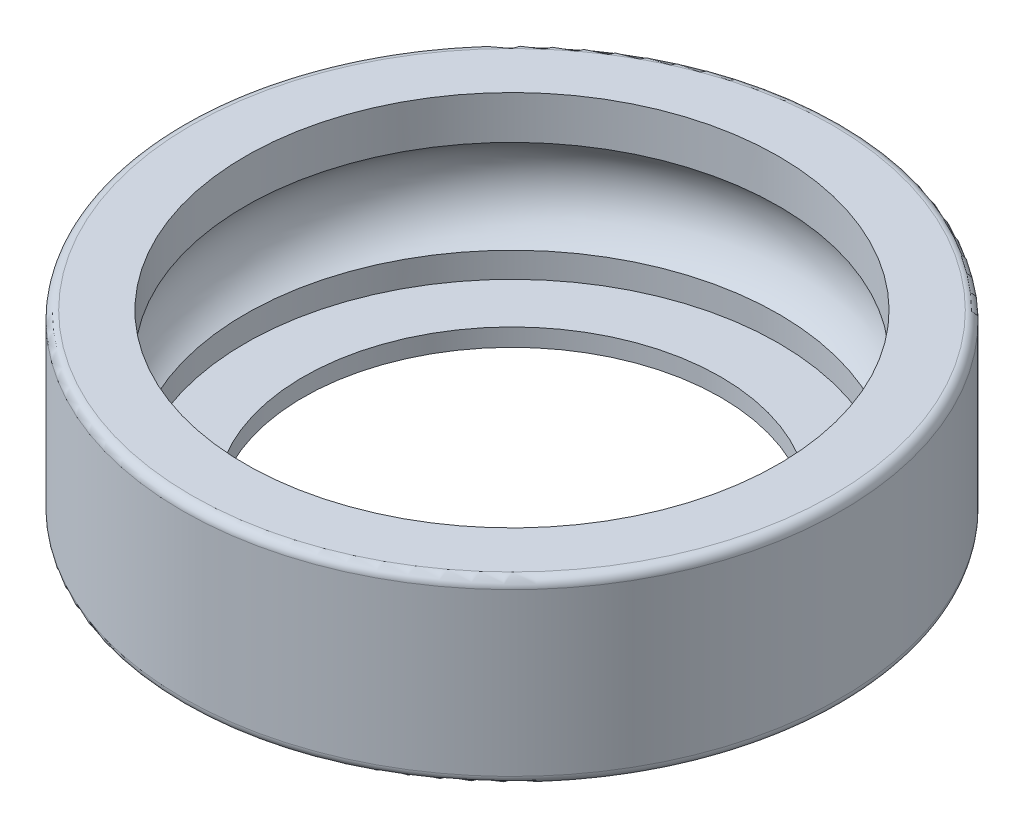
ISO-10303-21;
HEADER;
FILE_DESCRIPTION(('STEP AP214'),'2;1');
FILE_NAME('part.step','',(''),(''),'','','');
FILE_SCHEMA(('AUTOMOTIVE_DESIGN { 1 0 10303 214 1 1 1 1 }'));
ENDSEC;
DATA;
#1=APPLICATION_CONTEXT('core data for automotive mechanical design processes');
#2=APPLICATION_PROTOCOL_DEFINITION('international standard','automotive_design',2000,#1);
#3=PRODUCT_CONTEXT('',#1,'mechanical');
#4=PRODUCT('Part','Part','',(#3));
#5=PRODUCT_RELATED_PRODUCT_CATEGORY('part','',(#4));
#6=PRODUCT_DEFINITION_FORMATION('','',#4);
#7=PRODUCT_DEFINITION_CONTEXT('part definition',#1,'design');
#8=PRODUCT_DEFINITION('design','',#6,#7);
#9=PRODUCT_DEFINITION_SHAPE('','',#8);
#10=(LENGTH_UNIT() NAMED_UNIT(*) SI_UNIT(.MILLI.,.METRE.));
#11=(NAMED_UNIT(*) PLANE_ANGLE_UNIT() SI_UNIT($,.RADIAN.));
#12=(NAMED_UNIT(*) SI_UNIT($,.STERADIAN.) SOLID_ANGLE_UNIT());
#13=UNCERTAINTY_MEASURE_WITH_UNIT(LENGTH_MEASURE(1.E-05),#10,'distance_accuracy_value','');
#14=(GEOMETRIC_REPRESENTATION_CONTEXT(3) GLOBAL_UNCERTAINTY_ASSIGNED_CONTEXT((#13)) GLOBAL_UNIT_ASSIGNED_CONTEXT((#10,
#11,#12)) REPRESENTATION_CONTEXT('',''));
#15=CARTESIAN_POINT('',(0.,0.,0.));
#16=DIRECTION('',(0.,0.,1.));
#17=DIRECTION('',(1.,0.,0.));
#18=AXIS2_PLACEMENT_3D('',#15,#16,#17);
#19=CARTESIAN_POINT('',(0.,-1.02057713659401,0.));
#20=DIRECTION('',(0.,1.,0.));
#21=DIRECTION('',(0.,0.,1.));
#22=AXIS2_PLACEMENT_3D('',#19,#20,#21);
#23=CYLINDRICAL_SURFACE('',#22,8.9);
#24=CARTESIAN_POINT('',(0.,-1.44115427318801,0.));
#25=DIRECTION('',(0.,1.,0.));
#26=DIRECTION('',(0.,0.,1.));
#27=AXIS2_PLACEMENT_3D('',#24,#25,#26);
#28=CIRCLE('',#27,8.9);
#29=CARTESIAN_POINT('',(4.81170327535484,-1.44115427318801,7.48715644219751));
#30=VERTEX_POINT('',#29);
#31=EDGE_CURVE('E117',#30,#30,#28,.T.);
#32=ORIENTED_EDGE('',*,*,#31,.F.);
#33=EDGE_LOOP('',(#32));
#34=FACE_BOUND('',#33,.T.);
#35=CARTESIAN_POINT('',(0.,0.,0.));
#36=DIRECTION('',(0.,1.,0.));
#37=DIRECTION('',(0.,0.,1.));
#38=AXIS2_PLACEMENT_3D('',#35,#36,#37);
#39=CIRCLE('',#38,8.9);
#40=CARTESIAN_POINT('',(0.,0.,-8.9));
#41=VERTEX_POINT('',#40);
#42=EDGE_CURVE('E11',#41,#41,#39,.T.);
#43=ORIENTED_EDGE('',*,*,#42,.T.);
#44=EDGE_LOOP('',(#43));
#45=FACE_BOUND('',#44,.T.);
#46=ADVANCED_FACE('F16',(#34,#45),#23,.F.);
#47=CARTESIAN_POINT('',(0.,0.,9.8));
#48=DIRECTION('',(0.,1.,0.));
#49=DIRECTION('',(1.,0.,0.));
#50=AXIS2_PLACEMENT_3D('',#47,#48,#49);
#51=PLANE('',#50);
#52=CARTESIAN_POINT('',(0.,0.,0.));
#53=DIRECTION('',(0.,1.,0.));
#54=DIRECTION('',(0.,0.,1.));
#55=AXIS2_PLACEMENT_3D('',#52,#53,#54);
#56=CIRCLE('',#55,10.7);
#57=CARTESIAN_POINT('',(0.,0.,-10.7));
#58=VERTEX_POINT('',#57);
#59=EDGE_CURVE('E104',#58,#58,#56,.T.);
#60=ORIENTED_EDGE('',*,*,#59,.T.);
#61=EDGE_LOOP('',(#60));
#62=FACE_BOUND('',#61,.T.);
#63=ORIENTED_EDGE('',*,*,#42,.F.);
#64=EDGE_LOOP('',(#63));
#65=FACE_BOUND('',#64,.T.);
#66=ADVANCED_FACE('F105',(#62,#65),#51,.T.);
#67=CARTESIAN_POINT('',(0.,-4.979422863406,0.));
#68=DIRECTION('',(0.,1.,0.));
#69=DIRECTION('',(0.,0.,1.));
#70=AXIS2_PLACEMENT_3D('',#67,#68,#69);
#71=CYLINDRICAL_SURFACE('',#70,8.9);
#72=CARTESIAN_POINT('',(0.,-5.4,0.));
#73=DIRECTION('',(0.,1.,0.));
#74=DIRECTION('',(0.,0.,1.));
#75=AXIS2_PLACEMENT_3D('',#72,#73,#74);
#76=CIRCLE('',#75,8.9);
#77=CARTESIAN_POINT('',(0.,-5.4,-8.9));
#78=VERTEX_POINT('',#77);
#79=EDGE_CURVE('E20',#78,#78,#76,.T.);
#80=ORIENTED_EDGE('',*,*,#79,.F.);
#81=EDGE_LOOP('',(#80));
#82=FACE_BOUND('',#81,.T.);
#83=CARTESIAN_POINT('',(0.,-4.55884572681199,0.));
#84=DIRECTION('',(0.,1.,0.));
#85=DIRECTION('',(0.,0.,1.));
#86=AXIS2_PLACEMENT_3D('',#83,#84,#85);
#87=CIRCLE('',#86,8.9);
#88=CARTESIAN_POINT('',(4.81170327535483,-4.55884572681199,7.4871564421975));
#89=VERTEX_POINT('',#88);
#90=EDGE_CURVE('E109',#89,#89,#87,.T.);
#91=ORIENTED_EDGE('',*,*,#90,.T.);
#92=EDGE_LOOP('',(#91));
#93=FACE_BOUND('',#92,.T.);
#94=ADVANCED_FACE('F163',(#82,#93),#71,.F.);
#95=CARTESIAN_POINT('',(0.,-5.4,8.989));
#96=DIRECTION('',(0.,-1.,0.));
#97=DIRECTION('',(-1.,0.,0.));
#98=AXIS2_PLACEMENT_3D('',#95,#96,#97);
#99=PLANE('',#98);
#100=ORIENTED_EDGE('',*,*,#79,.T.);
#101=EDGE_LOOP('',(#100));
#102=FACE_BOUND('',#101,.T.);
#103=CARTESIAN_POINT('',(0.,-5.4,0.));
#104=DIRECTION('',(0.,1.,0.));
#105=DIRECTION('',(0.,0.,1.));
#106=AXIS2_PLACEMENT_3D('',#103,#104,#105);
#107=CIRCLE('',#106,9.078);
#108=CARTESIAN_POINT('',(0.,-5.4,-9.078));
#109=VERTEX_POINT('',#108);
#110=EDGE_CURVE('E135',#109,#109,#107,.T.);
#111=ORIENTED_EDGE('',*,*,#110,.F.);
#112=EDGE_LOOP('',(#111));
#113=FACE_BOUND('',#112,.T.);
#114=ADVANCED_FACE('F183',(#102,#113),#99,.T.);
#115=CARTESIAN_POINT('',(0.,-0.3,0.));
#116=DIRECTION('',(0.,1.,0.));
#117=DIRECTION('',(0.,0.,1.));
#118=AXIS2_PLACEMENT_3D('',#115,#116,#117);
#119=TOROIDAL_SURFACE('',#118,10.7,0.3);
#120=ORIENTED_EDGE('',*,*,#59,.F.);
#121=EDGE_LOOP('',(#120));
#122=FACE_BOUND('',#121,.T.);
#123=CARTESIAN_POINT('',(0.,-0.3,0.));
#124=DIRECTION('',(0.,1.,0.));
#125=DIRECTION('',(0.,0.,1.));
#126=AXIS2_PLACEMENT_3D('',#123,#124,#125);
#127=CIRCLE('',#126,11.);
#128=CARTESIAN_POINT('',(0.,-0.3,-11.));
#129=VERTEX_POINT('',#128);
#130=EDGE_CURVE('E138',#129,#129,#127,.T.);
#131=ORIENTED_EDGE('',*,*,#130,.T.);
#132=EDGE_LOOP('',(#131));
#133=FACE_BOUND('',#132,.T.);
#134=ADVANCED_FACE('F190',(#122,#133),#119,.T.);
#135=CARTESIAN_POINT('',(0.,-3.,0.));
#136=DIRECTION('',(0.,1.,0.));
#137=DIRECTION('',(0.,0.,1.));
#138=AXIS2_PLACEMENT_3D('',#135,#136,#137);
#139=TOROIDAL_SURFACE('',#138,8.,1.8);
#140=ORIENTED_EDGE('',*,*,#90,.F.);
#141=EDGE_LOOP('',(#140));
#142=FACE_BOUND('',#141,.T.);
#143=ORIENTED_EDGE('',*,*,#31,.T.);
#144=EDGE_LOOP('',(#143));
#145=FACE_BOUND('',#144,.T.);
#146=ADVANCED_FACE('F155',(#142,#145),#139,.F.);
#147=CARTESIAN_POINT('',(0.,-5.7,0.));
#148=DIRECTION('',(0.,1.,0.));
#149=DIRECTION('',(0.,0.,1.));
#150=AXIS2_PLACEMENT_3D('',#147,#148,#149);
#151=CYLINDRICAL_SURFACE('',#150,9.078);
#152=CARTESIAN_POINT('',(0.,-5.41,0.));
#153=DIRECTION('',(0.,-1.,0.));
#154=DIRECTION('',(0.,0.,1.));
#155=AXIS2_PLACEMENT_3D('',#152,#153,#154);
#156=CIRCLE('',#155,9.078);
#157=CARTESIAN_POINT('',(0.,-5.41,-9.078));
#158=VERTEX_POINT('',#157);
#159=EDGE_CURVE('E121',#158,#158,#156,.T.);
#160=ORIENTED_EDGE('',*,*,#159,.T.);
#161=EDGE_LOOP('',(#160));
#162=FACE_BOUND('',#161,.T.);
#163=ORIENTED_EDGE('',*,*,#110,.T.);
#164=EDGE_LOOP('',(#163));
#165=FACE_BOUND('',#164,.T.);
#166=ADVANCED_FACE('F175',(#162,#165),#151,.F.);
#167=CARTESIAN_POINT('',(0.,-3.,0.));
#168=DIRECTION('',(0.,1.,0.));
#169=DIRECTION('',(0.,0.,1.));
#170=AXIS2_PLACEMENT_3D('',#167,#168,#169);
#171=CYLINDRICAL_SURFACE('',#170,11.);
#172=ORIENTED_EDGE('',*,*,#130,.F.);
#173=EDGE_LOOP('',(#172));
#174=FACE_BOUND('',#173,.T.);
#175=CARTESIAN_POINT('',(0.,-5.7,0.));
#176=DIRECTION('',(0.,1.,0.));
#177=DIRECTION('',(0.,0.,1.));
#178=AXIS2_PLACEMENT_3D('',#175,#176,#177);
#179=CIRCLE('',#178,11.);
#180=CARTESIAN_POINT('',(0.,-5.7,-11.));
#181=VERTEX_POINT('',#180);
#182=EDGE_CURVE('E125',#181,#181,#179,.T.);
#183=ORIENTED_EDGE('',*,*,#182,.T.);
#184=EDGE_LOOP('',(#183));
#185=FACE_BOUND('',#184,.T.);
#186=ADVANCED_FACE('F171',(#174,#185),#171,.T.);
#187=CARTESIAN_POINT('',(0.,-5.41,8.023));
#188=DIRECTION('',(0.,1.,0.));
#189=DIRECTION('',(1.,0.,0.));
#190=AXIS2_PLACEMENT_3D('',#187,#188,#189);
#191=PLANE('',#190);
#192=CARTESIAN_POINT('',(0.,-5.41,0.));
#193=DIRECTION('',(0.,-1.,0.));
#194=DIRECTION('',(0.,0.,1.));
#195=AXIS2_PLACEMENT_3D('',#192,#193,#194);
#196=CIRCLE('',#195,6.968);
#197=CARTESIAN_POINT('',(0.,-5.41,-6.968));
#198=VERTEX_POINT('',#197);
#199=EDGE_CURVE('E123',#198,#198,#196,.T.);
#200=ORIENTED_EDGE('',*,*,#199,.T.);
#201=EDGE_LOOP('',(#200));
#202=FACE_BOUND('',#201,.T.);
#203=ORIENTED_EDGE('',*,*,#159,.F.);
#204=EDGE_LOOP('',(#203));
#205=FACE_BOUND('',#204,.T.);
#206=ADVANCED_FACE('F174',(#202,#205),#191,.T.);
#207=CARTESIAN_POINT('',(0.,-5.7,0.));
#208=DIRECTION('',(0.,1.,0.));
#209=DIRECTION('',(0.,0.,1.));
#210=AXIS2_PLACEMENT_3D('',#207,#208,#209);
#211=TOROIDAL_SURFACE('',#210,10.7,0.3);
#212=ORIENTED_EDGE('',*,*,#182,.F.);
#213=EDGE_LOOP('',(#212));
#214=FACE_BOUND('',#213,.T.);
#215=CARTESIAN_POINT('',(0.,-6.,0.));
#216=DIRECTION('',(0.,1.,0.));
#217=DIRECTION('',(0.,0.,1.));
#218=AXIS2_PLACEMENT_3D('',#215,#216,#217);
#219=CIRCLE('',#218,10.7);
#220=CARTESIAN_POINT('',(0.,-6.,-10.7));
#221=VERTEX_POINT('',#220);
#222=EDGE_CURVE('E76',#221,#221,#219,.T.);
#223=ORIENTED_EDGE('',*,*,#222,.T.);
#224=EDGE_LOOP('',(#223));
#225=FACE_BOUND('',#224,.T.);
#226=ADVANCED_FACE('F179',(#214,#225),#211,.T.);
#227=CARTESIAN_POINT('',(0.,-5.705,0.));
#228=DIRECTION('',(0.,-1.,0.));
#229=DIRECTION('',(0.,0.,1.));
#230=AXIS2_PLACEMENT_3D('',#227,#228,#229);
#231=CYLINDRICAL_SURFACE('',#230,6.968);
#232=ORIENTED_EDGE('',*,*,#199,.F.);
#233=EDGE_LOOP('',(#232));
#234=FACE_BOUND('',#233,.T.);
#235=CARTESIAN_POINT('',(0.,-6.,0.));
#236=DIRECTION('',(0.,-1.,0.));
#237=DIRECTION('',(0.,0.,1.));
#238=AXIS2_PLACEMENT_3D('',#235,#236,#237);
#239=CIRCLE('',#238,6.968);
#240=CARTESIAN_POINT('',(0.,-6.,-6.968));
#241=VERTEX_POINT('',#240);
#242=EDGE_CURVE('E65',#241,#241,#239,.T.);
#243=ORIENTED_EDGE('',*,*,#242,.T.);
#244=EDGE_LOOP('',(#243));
#245=FACE_BOUND('',#244,.T.);
#246=ADVANCED_FACE('F170',(#234,#245),#231,.F.);
#247=CARTESIAN_POINT('',(0.,-6.,9.889));
#248=DIRECTION('',(0.,-1.,0.));
#249=DIRECTION('',(-1.,0.,0.));
#250=AXIS2_PLACEMENT_3D('',#247,#248,#249);
#251=PLANE('',#250);
#252=CARTESIAN_POINT('',(0.,-6.,0.));
#253=DIRECTION('',(0.,1.,0.));
#254=DIRECTION('',(0.,0.,1.));
#255=AXIS2_PLACEMENT_3D('',#252,#253,#254);
#256=CIRCLE('',#255,9.078);
#257=CARTESIAN_POINT('',(0.,-6.,-9.078));
#258=VERTEX_POINT('',#257);
#259=EDGE_CURVE('E57',#258,#258,#256,.T.);
#260=ORIENTED_EDGE('',*,*,#259,.T.);
#261=EDGE_LOOP('',(#260));
#262=FACE_BOUND('',#261,.T.);
#263=ORIENTED_EDGE('',*,*,#222,.F.);
#264=EDGE_LOOP('',(#263));
#265=FACE_BOUND('',#264,.T.);
#266=ADVANCED_FACE('F166',(#262,#265),#251,.T.);
#267=CARTESIAN_POINT('',(0.,-6.,7.878));
#268=DIRECTION('',(0.,-1.,0.));
#269=DIRECTION('',(-1.,0.,0.));
#270=AXIS2_PLACEMENT_3D('',#267,#268,#269);
#271=PLANE('',#270);
#272=CARTESIAN_POINT('',(0.,-6.,0.));
#273=DIRECTION('',(0.,-1.,0.));
#274=DIRECTION('',(0.,0.,1.));
#275=AXIS2_PLACEMENT_3D('',#272,#273,#274);
#276=CIRCLE('',#275,8.788);
#277=CARTESIAN_POINT('',(0.,-6.,-8.788));
#278=VERTEX_POINT('',#277);
#279=EDGE_CURVE('E131',#278,#278,#276,.T.);
#280=ORIENTED_EDGE('',*,*,#279,.T.);
#281=EDGE_LOOP('',(#280));
#282=FACE_BOUND('',#281,.T.);
#283=ORIENTED_EDGE('',*,*,#242,.F.);
#284=EDGE_LOOP('',(#283));
#285=FACE_BOUND('',#284,.T.);
#286=ADVANCED_FACE('F169',(#282,#285),#271,.T.);
#287=CARTESIAN_POINT('',(0.,-5.7,0.));
#288=DIRECTION('',(0.,1.,0.));
#289=DIRECTION('',(0.,0.,1.));
#290=AXIS2_PLACEMENT_3D('',#287,#288,#289);
#291=CYLINDRICAL_SURFACE('',#290,9.078);
#292=ORIENTED_EDGE('',*,*,#259,.F.);
#293=EDGE_LOOP('',(#292));
#294=FACE_BOUND('',#293,.T.);
#295=CARTESIAN_POINT('',(0.,-5.71,0.));
#296=DIRECTION('',(0.,-1.,0.));
#297=DIRECTION('',(0.,0.,1.));
#298=AXIS2_PLACEMENT_3D('',#295,#296,#297);
#299=CIRCLE('',#298,9.078);
#300=CARTESIAN_POINT('',(0.,-5.71,-9.078));
#301=VERTEX_POINT('',#300);
#302=EDGE_CURVE('E134',#301,#301,#299,.T.);
#303=ORIENTED_EDGE('',*,*,#302,.F.);
#304=EDGE_LOOP('',(#303));
#305=FACE_BOUND('',#304,.T.);
#306=ADVANCED_FACE('F192',(#294,#305),#291,.F.);
#307=CARTESIAN_POINT('',(0.,-5.855,0.));
#308=DIRECTION('',(0.,1.,0.));
#309=DIRECTION('',(0.,0.,1.));
#310=AXIS2_PLACEMENT_3D('',#307,#308,#309);
#311=CONICAL_SURFACE('',#310,8.933,0.785398163397447);
#312=ORIENTED_EDGE('',*,*,#279,.F.);
#313=EDGE_LOOP('',(#312));
#314=FACE_BOUND('',#313,.T.);
#315=ORIENTED_EDGE('',*,*,#302,.T.);
#316=EDGE_LOOP('',(#315));
#317=FACE_BOUND('',#316,.T.);
#318=ADVANCED_FACE('F18',(#314,#317),#311,.T.);
#319=CLOSED_SHELL('',(#46,#66,#94,#114,#134,#146,#166,#186,#206,#226,#246,#266,#286,#306,#318));
#320=MANIFOLD_SOLID_BREP('B1',#319);
#321=ADVANCED_BREP_SHAPE_REPRESENTATION('',(#18,#320),#14);
#322=SHAPE_DEFINITION_REPRESENTATION(#9,#321);
ENDSEC;
END-ISO-10303-21;
